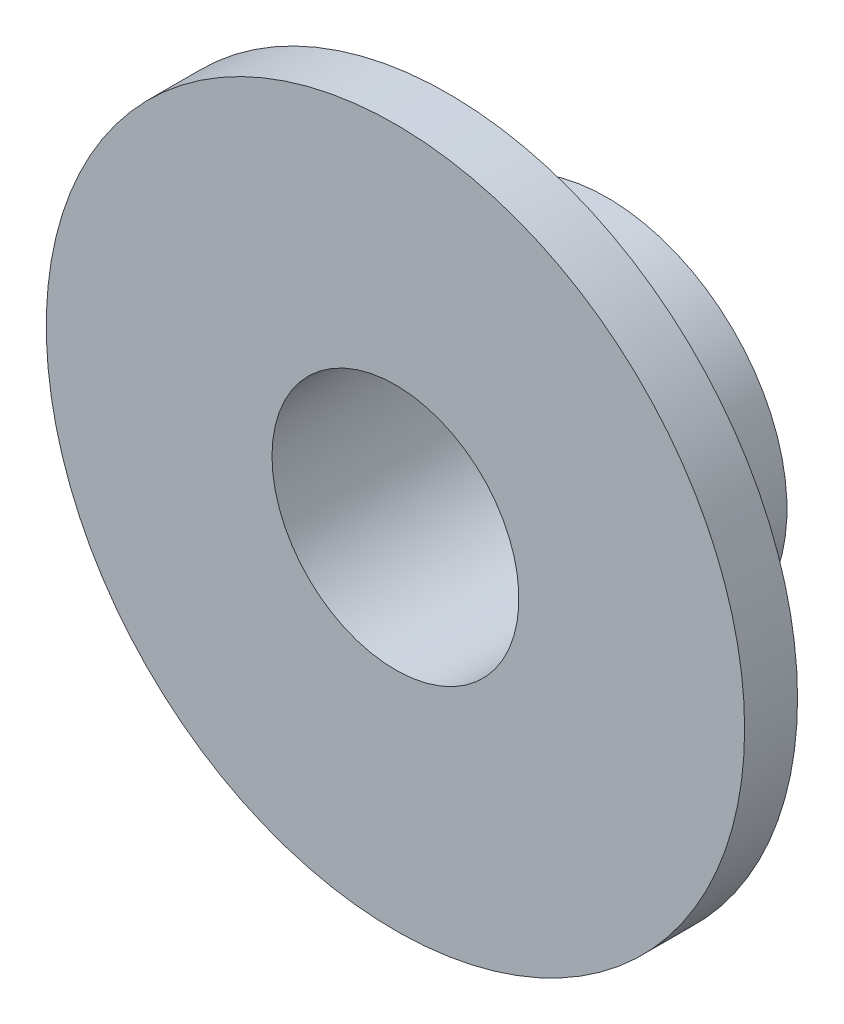
ISO-10303-21;
HEADER;
FILE_DESCRIPTION(('STEP AP214'),'2;1');
FILE_NAME('part.step','',(''),(''),'','','');
FILE_SCHEMA(('AUTOMOTIVE_DESIGN { 1 0 10303 214 1 1 1 1 }'));
ENDSEC;
DATA;
#1=APPLICATION_CONTEXT('core data for automotive mechanical design processes');
#2=APPLICATION_PROTOCOL_DEFINITION('international standard','automotive_design',2000,#1);
#3=PRODUCT_CONTEXT('',#1,'mechanical');
#4=PRODUCT('Part','Part','',(#3));
#5=PRODUCT_RELATED_PRODUCT_CATEGORY('part','',(#4));
#6=PRODUCT_DEFINITION_FORMATION('','',#4);
#7=PRODUCT_DEFINITION_CONTEXT('part definition',#1,'design');
#8=PRODUCT_DEFINITION('design','',#6,#7);
#9=PRODUCT_DEFINITION_SHAPE('','',#8);
#10=(LENGTH_UNIT() NAMED_UNIT(*) SI_UNIT(.MILLI.,.METRE.));
#11=(NAMED_UNIT(*) PLANE_ANGLE_UNIT() SI_UNIT($,.RADIAN.));
#12=(NAMED_UNIT(*) SI_UNIT($,.STERADIAN.) SOLID_ANGLE_UNIT());
#13=UNCERTAINTY_MEASURE_WITH_UNIT(LENGTH_MEASURE(1.E-05),#10,'distance_accuracy_value','');
#14=(GEOMETRIC_REPRESENTATION_CONTEXT(3) GLOBAL_UNCERTAINTY_ASSIGNED_CONTEXT((#13)) GLOBAL_UNIT_ASSIGNED_CONTEXT((#10,
#11,#12)) REPRESENTATION_CONTEXT('',''));
#15=CARTESIAN_POINT('',(0.,0.,0.));
#16=DIRECTION('',(0.,0.,1.));
#17=DIRECTION('',(1.,0.,0.));
#18=AXIS2_PLACEMENT_3D('',#15,#16,#17);
#19=CARTESIAN_POINT('',(13.7580337175194,17.3840666016993,30.4637785170683));
#20=DIRECTION('',(0.,0.,-1.));
#21=DIRECTION('',(-1.,0.,0.));
#22=AXIS2_PLACEMENT_3D('',#19,#20,#21);
#23=CYLINDRICAL_SURFACE('',#22,9.9);
#24=CARTESIAN_POINT('',(13.7580337175194,17.3840666016993,30.4637785170683));
#25=DIRECTION('',(0.,0.,1.));
#26=DIRECTION('',(1.,0.,0.));
#27=AXIS2_PLACEMENT_3D('',#24,#25,#26);
#28=CIRCLE('',#27,9.9);
#29=CARTESIAN_POINT('',(23.6580337175194,17.3840666016993,30.4637785170683));
#30=VERTEX_POINT('',#29);
#31=EDGE_CURVE('E39',#30,#30,#28,.T.);
#32=ORIENTED_EDGE('',*,*,#31,.F.);
#33=EDGE_LOOP('',(#32));
#34=FACE_BOUND('',#33,.T.);
#35=CARTESIAN_POINT('',(13.7580337175194,17.3840666016993,28.9637785170683));
#36=DIRECTION('',(0.,0.,1.));
#37=DIRECTION('',(1.,0.,0.));
#38=AXIS2_PLACEMENT_3D('',#35,#36,#37);
#39=CIRCLE('',#38,9.9);
#40=CARTESIAN_POINT('',(23.6580337175194,17.3840666016993,28.9637785170683));
#41=VERTEX_POINT('',#40);
#42=EDGE_CURVE('E35',#41,#41,#39,.T.);
#43=ORIENTED_EDGE('',*,*,#42,.T.);
#44=EDGE_LOOP('',(#43));
#45=FACE_BOUND('',#44,.T.);
#46=ADVANCED_FACE('F32',(#34,#45),#23,.T.);
#47=CARTESIAN_POINT('',(13.7580337175194,17.3840666016993,30.4637785170683));
#48=DIRECTION('',(0.,0.,1.));
#49=DIRECTION('',(1.,0.,0.));
#50=AXIS2_PLACEMENT_3D('',#47,#48,#49);
#51=PLANE('',#50);
#52=CARTESIAN_POINT('',(13.7580337175194,17.3840666016993,30.4637785170683));
#53=DIRECTION('',(0.,0.,-1.));
#54=DIRECTION('',(-1.,0.,0.));
#55=AXIS2_PLACEMENT_3D('',#52,#53,#54);
#56=CIRCLE('',#55,3.5);
#57=CARTESIAN_POINT('',(10.2580337175194,17.3840666016993,30.4637785170683));
#58=VERTEX_POINT('',#57);
#59=EDGE_CURVE('E48',#58,#58,#56,.T.);
#60=ORIENTED_EDGE('',*,*,#59,.T.);
#61=EDGE_LOOP('',(#60));
#62=FACE_BOUND('',#61,.T.);
#63=ORIENTED_EDGE('',*,*,#31,.T.);
#64=EDGE_LOOP('',(#63));
#65=FACE_BOUND('',#64,.T.);
#66=ADVANCED_FACE('F55',(#62,#65),#51,.T.);
#67=CARTESIAN_POINT('',(13.7580337175194,17.3840666016993,28.9637785170683));
#68=DIRECTION('',(0.,0.,1.));
#69=DIRECTION('',(1.,0.,0.));
#70=AXIS2_PLACEMENT_3D('',#67,#68,#69);
#71=PLANE('',#70);
#72=CARTESIAN_POINT('',(13.7580337175194,17.3840666016993,28.9637785170683));
#73=DIRECTION('',(0.,0.,-1.));
#74=DIRECTION('',(-1.,0.,0.));
#75=AXIS2_PLACEMENT_3D('',#72,#73,#74);
#76=CIRCLE('',#75,5.1);
#77=CARTESIAN_POINT('',(8.65803371751942,17.3840666016993,28.9637785170683));
#78=VERTEX_POINT('',#77);
#79=EDGE_CURVE('E10',#78,#78,#76,.T.);
#80=ORIENTED_EDGE('',*,*,#79,.F.);
#81=EDGE_LOOP('',(#80));
#82=FACE_BOUND('',#81,.T.);
#83=ORIENTED_EDGE('',*,*,#42,.F.);
#84=EDGE_LOOP('',(#83));
#85=FACE_BOUND('',#84,.T.);
#86=ADVANCED_FACE('F72',(#82,#85),#71,.F.);
#87=CARTESIAN_POINT('',(13.7580337175194,17.3840666016993,24.4637785170683));
#88=DIRECTION('',(0.,0.,1.));
#89=DIRECTION('',(1.,0.,0.));
#90=AXIS2_PLACEMENT_3D('',#87,#88,#89);
#91=CYLINDRICAL_SURFACE('',#90,5.1);
#92=CARTESIAN_POINT('',(13.7580337175194,17.3840666016993,24.4637785170683));
#93=DIRECTION('',(0.,0.,-1.));
#94=DIRECTION('',(-1.,0.,0.));
#95=AXIS2_PLACEMENT_3D('',#92,#93,#94);
#96=CIRCLE('',#95,5.1);
#97=CARTESIAN_POINT('',(8.65803371751942,17.3840666016993,24.4637785170683));
#98=VERTEX_POINT('',#97);
#99=EDGE_CURVE('E45',#98,#98,#96,.T.);
#100=ORIENTED_EDGE('',*,*,#99,.F.);
#101=EDGE_LOOP('',(#100));
#102=FACE_BOUND('',#101,.T.);
#103=ORIENTED_EDGE('',*,*,#79,.T.);
#104=EDGE_LOOP('',(#103));
#105=FACE_BOUND('',#104,.T.);
#106=ADVANCED_FACE('F67',(#102,#105),#91,.T.);
#107=CARTESIAN_POINT('',(13.7580337175194,17.3840666016993,24.4637785170683));
#108=DIRECTION('',(0.,0.,-1.));
#109=DIRECTION('',(-1.,0.,0.));
#110=AXIS2_PLACEMENT_3D('',#107,#108,#109);
#111=PLANE('',#110);
#112=CARTESIAN_POINT('',(13.7580337175194,17.3840666016993,24.4637785170683));
#113=DIRECTION('',(0.,0.,-1.));
#114=DIRECTION('',(-1.,0.,0.));
#115=AXIS2_PLACEMENT_3D('',#112,#113,#114);
#116=CIRCLE('',#115,3.5);
#117=CARTESIAN_POINT('',(10.2580337175194,17.3840666016993,24.4637785170683));
#118=VERTEX_POINT('',#117);
#119=EDGE_CURVE('E49',#118,#118,#116,.T.);
#120=ORIENTED_EDGE('',*,*,#119,.F.);
#121=EDGE_LOOP('',(#120));
#122=FACE_BOUND('',#121,.T.);
#123=ORIENTED_EDGE('',*,*,#99,.T.);
#124=EDGE_LOOP('',(#123));
#125=FACE_BOUND('',#124,.T.);
#126=ADVANCED_FACE('F61',(#122,#125),#111,.T.);
#127=CARTESIAN_POINT('',(13.7580337175194,17.3840666016993,30.4637785170683));
#128=DIRECTION('',(0.,0.,-1.));
#129=DIRECTION('',(-1.,0.,0.));
#130=AXIS2_PLACEMENT_3D('',#127,#128,#129);
#131=CYLINDRICAL_SURFACE('',#130,3.5);
#132=ORIENTED_EDGE('',*,*,#59,.F.);
#133=EDGE_LOOP('',(#132));
#134=FACE_BOUND('',#133,.T.);
#135=ORIENTED_EDGE('',*,*,#119,.T.);
#136=EDGE_LOOP('',(#135));
#137=FACE_BOUND('',#136,.T.);
#138=ADVANCED_FACE('F58',(#134,#137),#131,.F.);
#139=CLOSED_SHELL('',(#46,#66,#86,#106,#126,#138));
#140=MANIFOLD_SOLID_BREP('B2',#139);
#141=ADVANCED_BREP_SHAPE_REPRESENTATION('',(#18,#140),#14);
#142=SHAPE_DEFINITION_REPRESENTATION(#9,#141);
ENDSEC;
END-ISO-10303-21;
